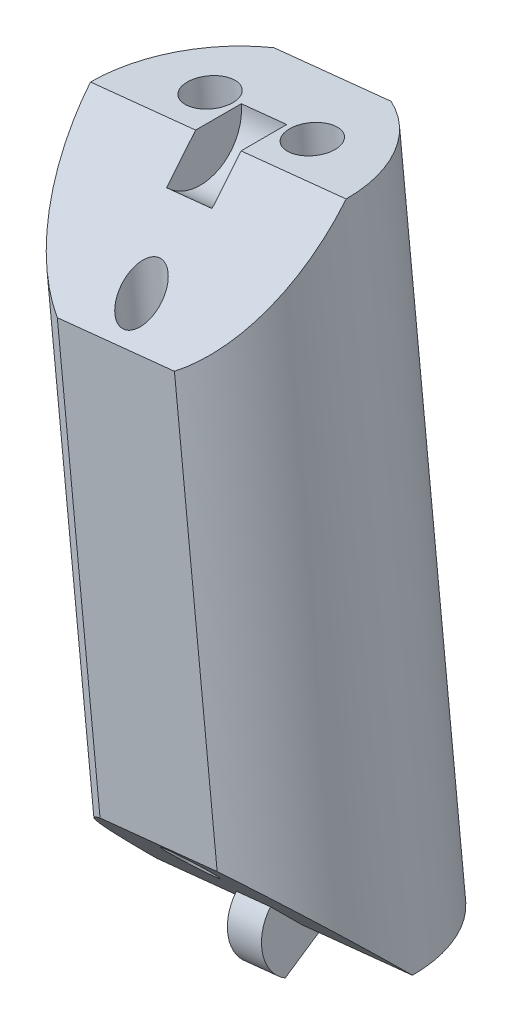
ISO-10303-21;
HEADER;
FILE_DESCRIPTION(('STEP AP214'),'2;1');
FILE_NAME('part.step','',(''),(''),'','','');
FILE_SCHEMA(('AUTOMOTIVE_DESIGN { 1 0 10303 214 1 1 1 1 }'));
ENDSEC;
DATA;
#1=APPLICATION_CONTEXT('core data for automotive mechanical design processes');
#2=APPLICATION_PROTOCOL_DEFINITION('international standard','automotive_design',2000,#1);
#3=PRODUCT_CONTEXT('',#1,'mechanical');
#4=PRODUCT('Part','Part','',(#3));
#5=PRODUCT_RELATED_PRODUCT_CATEGORY('part','',(#4));
#6=PRODUCT_DEFINITION_FORMATION('','',#4);
#7=PRODUCT_DEFINITION_CONTEXT('part definition',#1,'design');
#8=PRODUCT_DEFINITION('design','',#6,#7);
#9=PRODUCT_DEFINITION_SHAPE('','',#8);
#10=(LENGTH_UNIT() NAMED_UNIT(*) SI_UNIT(.MILLI.,.METRE.));
#11=(NAMED_UNIT(*) PLANE_ANGLE_UNIT() SI_UNIT($,.RADIAN.));
#12=(NAMED_UNIT(*) SI_UNIT($,.STERADIAN.) SOLID_ANGLE_UNIT());
#13=UNCERTAINTY_MEASURE_WITH_UNIT(LENGTH_MEASURE(1.E-05),#10,'distance_accuracy_value','');
#14=(GEOMETRIC_REPRESENTATION_CONTEXT(3) GLOBAL_UNCERTAINTY_ASSIGNED_CONTEXT((#13)) GLOBAL_UNIT_ASSIGNED_CONTEXT((#10,
#11,#12)) REPRESENTATION_CONTEXT('',''));
#15=CARTESIAN_POINT('',(0.,0.,0.));
#16=DIRECTION('',(0.,0.,1.));
#17=DIRECTION('',(1.,0.,0.));
#18=AXIS2_PLACEMENT_3D('',#15,#16,#17);
#19=CARTESIAN_POINT('',(-5.32693230149214,152.494838402009,0.));
#20=DIRECTION('',(-0.103150523023817,0.994665757729657,0.));
#21=DIRECTION('',(-0.994665757729657,-0.103150523023817,0.));
#22=AXIS2_PLACEMENT_3D('',#19,#20,#21);
#23=CYLINDRICAL_SURFACE('',#22,9.);
#24=CARTESIAN_POINT('',(-5.32693230149214,152.494838402009,0.));
#25=DIRECTION('',(0.103150523023817,-0.994665757729657,0.));
#26=DIRECTION('',(0.994665757729657,0.103150523023817,0.));
#27=AXIS2_PLACEMENT_3D('',#24,#25,#26);
#28=CIRCLE('',#27,9.);
#29=CARTESIAN_POINT('',(-1.22582032018774,152.920138903774,-8.));
#30=VERTEX_POINT('',#29);
#31=CARTESIAN_POINT('',(3.62505951807477,153.423193109224,0.));
#32=VERTEX_POINT('',#31);
#33=EDGE_CURVE('E143',#30,#32,#28,.T.);
#34=ORIENTED_EDGE('',*,*,#33,.F.);
#35=DIRECTION('',(-0.103150523023817,0.994665757729657,0.));
#36=VECTOR('',#35,1.);
#37=CARTESIAN_POINT('',(-1.22582032018774,152.920138903774,-8.));
#38=LINE('',#37,#36);
#39=CARTESIAN_POINT('',(-5.86759385625949,197.680098001609,-8.));
#40=VERTEX_POINT('',#39);
#41=EDGE_CURVE('E11',#30,#40,#38,.T.);
#42=ORIENTED_EDGE('',*,*,#41,.T.);
#43=CARTESIAN_POINT('',(-9.9687058375639,197.254797499844,0.));
#44=DIRECTION('',(0.103150523023817,-0.994665757729657,0.));
#45=DIRECTION('',(0.994665757729657,0.103150523023817,0.));
#46=AXIS2_PLACEMENT_3D('',#43,#44,#45);
#47=CIRCLE('',#46,9.);
#48=CARTESIAN_POINT('',(-1.01671401799698,198.183152207058,0.));
#49=VERTEX_POINT('',#48);
#50=EDGE_CURVE('E160',#40,#49,#47,.T.);
#51=ORIENTED_EDGE('',*,*,#50,.T.);
#52=CARTESIAN_POINT('',(-9.9687058375639,197.254797499844,0.));
#53=DIRECTION('',(0.0729384343130804,-0.703334902304701,-0.707106781186543));
#54=DIRECTION('',(-0.0729384343130795,0.703334902304692,-0.707106781186552));
#55=AXIS2_PLACEMENT_3D('',#52,#53,#54);
#56=ELLIPSE('',#55,12.7279220613578,9.);
#57=CARTESIAN_POINT('',(-5.04238967206898,189.722771939772,8.));
#58=VERTEX_POINT('',#57);
#59=EDGE_CURVE('E288',#49,#58,#56,.T.);
#60=ORIENTED_EDGE('',*,*,#59,.T.);
#61=DIRECTION('',(-0.103150523023817,0.994665757729657,0.));
#62=VECTOR('',#61,1.);
#63=CARTESIAN_POINT('',(-1.22582032018774,152.920138903774,8.));
#64=LINE('',#63,#62);
#65=CARTESIAN_POINT('',(-2.05102450437827,160.877464965611,8.));
#66=VERTEX_POINT('',#65);
#67=EDGE_CURVE('E175',#58,#66,#64,.F.);
#68=ORIENTED_EDGE('',*,*,#67,.T.);
#69=CARTESIAN_POINT('',(-5.32693230149215,152.494838402009,0.));
#70=DIRECTION('',(-0.0729384343130803,0.7033349023047,-0.707106781186544));
#71=DIRECTION('',(-0.0729384343130796,0.703334902304693,0.707106781186551));
#72=AXIS2_PLACEMENT_3D('',#69,#70,#71);
#73=ELLIPSE('',#72,12.7279220613578,9.);
#74=EDGE_CURVE('E151',#66,#32,#73,.T.);
#75=ORIENTED_EDGE('',*,*,#74,.T.);
#76=EDGE_LOOP('',(#34,#42,#51,#60,#68,#75));
#77=FACE_BOUND('',#76,.T.);
#78=ADVANCED_FACE('F39',(#77),#23,.T.);
#79=CARTESIAN_POINT('',(-9.9687058375639,197.254797499844,0.));
#80=DIRECTION('',(0.103150523023817,-0.994665757729657,0.));
#81=DIRECTION('',(0.994665757729657,0.103150523023817,0.));
#82=AXIS2_PLACEMENT_3D('',#79,#80,#81);
#83=PLANE('',#82);
#84=CARTESIAN_POINT('',(-6.38790910973713,197.62613938273,-3.));
#85=DIRECTION('',(0.103150523023817,-0.994665757729657,0.));
#86=DIRECTION('',(0.994665757729657,0.103150523023817,0.));
#87=AXIS2_PLACEMENT_3D('',#84,#85,#86);
#88=CIRCLE('',#87,1.6);
#89=CARTESIAN_POINT('',(-4.79644389736968,197.791180219568,-3.));
#90=VERTEX_POINT('',#89);
#91=EDGE_CURVE('E190',#90,#90,#88,.T.);
#92=ORIENTED_EDGE('',*,*,#91,.T.);
#93=EDGE_LOOP('',(#92));
#94=FACE_BOUND('',#93,.T.);
#95=CARTESIAN_POINT('',(-13.5495025653907,196.883455616958,-3.));
#96=DIRECTION('',(0.103150523023817,-0.994665757729657,0.));
#97=DIRECTION('',(0.994665757729657,0.103150523023817,0.));
#98=AXIS2_PLACEMENT_3D('',#95,#96,#97);
#99=CIRCLE('',#98,1.6);
#100=CARTESIAN_POINT('',(-11.9580373530232,197.048496453796,-3.));
#101=VERTEX_POINT('',#100);
#102=EDGE_CURVE('E185',#101,#101,#99,.T.);
#103=ORIENTED_EDGE('',*,*,#102,.T.);
#104=EDGE_LOOP('',(#103));
#105=FACE_BOUND('',#104,.T.);
#106=ORIENTED_EDGE('',*,*,#50,.F.);
#107=DIRECTION('',(-0.994665757729657,-0.103150523023817,0.));
#108=VECTOR('',#107,1.);
#109=CARTESIAN_POINT('',(-9.9687058375639,197.254797499844,-8.));
#110=LINE('',#109,#108);
#111=CARTESIAN_POINT('',(-14.0698178188683,196.829496998079,-8.));
#112=VERTEX_POINT('',#111);
#113=EDGE_CURVE('E134',#40,#112,#110,.T.);
#114=ORIENTED_EDGE('',*,*,#113,.T.);
#115=CARTESIAN_POINT('',(-18.9206976571308,196.32644279263,0.));
#116=VERTEX_POINT('',#115);
#117=EDGE_CURVE('E154',#116,#112,#47,.T.);
#118=ORIENTED_EDGE('',*,*,#117,.F.);
#119=DIRECTION('',(0.994665757729657,0.103150523023817,0.));
#120=VECTOR('',#119,1.);
#121=CARTESIAN_POINT('',(-9.9687058375639,197.254797499844,0.));
#122=LINE('',#121,#120);
#123=CARTESIAN_POINT('',(-11.5601710499314,197.089756663006,0.));
#124=VERTEX_POINT('',#123);
#125=EDGE_CURVE('E166',#116,#124,#122,.T.);
#126=ORIENTED_EDGE('',*,*,#125,.T.);
#127=DIRECTION('',(0.,0.,-1.));
#128=VECTOR('',#127,1.);
#129=CARTESIAN_POINT('',(-11.5601710499314,197.089756663006,0.));
#130=LINE('',#129,#128);
#131=CARTESIAN_POINT('',(-11.5601710499314,197.089756663006,-3.2));
#132=VERTEX_POINT('',#131);
#133=EDGE_CURVE('E220',#124,#132,#130,.T.);
#134=ORIENTED_EDGE('',*,*,#133,.T.);
#135=DIRECTION('',(-0.994665757729657,-0.103150523023817,0.));
#136=VECTOR('',#135,1.);
#137=CARTESIAN_POINT('',(-8.37724062519648,197.419838336682,-3.2));
#138=LINE('',#137,#136);
#139=CARTESIAN_POINT('',(-8.37724062519648,197.419838336682,-3.2));
#140=VERTEX_POINT('',#139);
#141=EDGE_CURVE('E233',#140,#132,#138,.T.);
#142=ORIENTED_EDGE('',*,*,#141,.F.);
#143=DIRECTION('',(0.,0.,-1.));
#144=VECTOR('',#143,1.);
#145=CARTESIAN_POINT('',(-8.37724062519648,197.419838336682,0.));
#146=LINE('',#145,#144);
#147=CARTESIAN_POINT('',(-8.37724062519648,197.419838336682,0.));
#148=VERTEX_POINT('',#147);
#149=EDGE_CURVE('E221',#148,#140,#146,.T.);
#150=ORIENTED_EDGE('',*,*,#149,.F.);
#151=EDGE_CURVE('E158',#148,#49,#122,.T.);
#152=ORIENTED_EDGE('',*,*,#151,.T.);
#153=EDGE_LOOP('',(#106,#114,#118,#126,#134,#142,#150,#152));
#154=FACE_BOUND('',#153,.T.);
#155=ADVANCED_FACE('F201',(#94,#105,#154),#83,.F.);
#156=CARTESIAN_POINT('',(3.57567090654064,198.659399532566,0.));
#157=DIRECTION('',(0.0729384343130804,-0.703334902304701,-0.707106781186543));
#158=DIRECTION('',(0.,0.708995228875744,-0.705213276556413));
#159=AXIS2_PLACEMENT_3D('',#156,#157,#158);
#160=PLANE('',#159);
#161=CARTESIAN_POINT('',(-9.34980269942101,191.286802953466,6.));
#162=DIRECTION('',(0.0729384343130804,-0.703334902304701,-0.707106781186543));
#163=DIRECTION('',(-0.0729384343130795,0.703334902304692,-0.707106781186552));
#164=AXIS2_PLACEMENT_3D('',#161,#162,#163);
#165=ELLIPSE('',#164,1.97989898732232,1.4);
#166=CARTESIAN_POINT('',(-9.49421343165435,192.679335014288,4.6));
#167=VERTEX_POINT('',#166);
#168=EDGE_CURVE('E180',#167,#167,#165,.T.);
#169=ORIENTED_EDGE('',*,*,#168,.T.);
#170=EDGE_LOOP('',(#169));
#171=FACE_BOUND('',#170,.T.);
#172=CARTESIAN_POINT('',(-13.2446136346778,188.872170936242,8.));
#173=VERTEX_POINT('',#172);
#174=EDGE_CURVE('E287',#173,#116,#56,.T.);
#175=ORIENTED_EDGE('',*,*,#174,.F.);
#176=DIRECTION('',(0.994665757729657,0.103150523023817,0.));
#177=VECTOR('',#176,1.);
#178=CARTESIAN_POINT('',(4.40087509073116,190.702073470729,8.));
#179=LINE('',#178,#177);
#180=EDGE_CURVE('E204',#173,#58,#179,.T.);
#181=ORIENTED_EDGE('',*,*,#180,.T.);
#182=ORIENTED_EDGE('',*,*,#59,.F.);
#183=ORIENTED_EDGE('',*,*,#151,.F.);
#184=DIRECTION('',(-0.0729384343130808,0.703334902304703,-0.707106781186541));
#185=VECTOR('',#184,1.);
#186=CARTESIAN_POINT('',(-8.14383763539462,195.169166649307,2.26274169979694));
#187=LINE('',#186,#185);
#188=CARTESIAN_POINT('',(-8.14383763539462,195.169166649307,2.26274169979694));
#189=VERTEX_POINT('',#188);
#190=EDGE_CURVE('E230',#189,#148,#187,.T.);
#191=ORIENTED_EDGE('',*,*,#190,.F.);
#192=DIRECTION('',(-0.994665757729657,-0.103150523023817,0.));
#193=VECTOR('',#192,1.);
#194=CARTESIAN_POINT('',(-8.14383763539462,195.169166649307,2.26274169979694));
#195=LINE('',#194,#193);
#196=CARTESIAN_POINT('',(-11.3267680601295,194.839084975631,2.26274169979694));
#197=VERTEX_POINT('',#196);
#198=EDGE_CURVE('E243',#189,#197,#195,.T.);
#199=ORIENTED_EDGE('',*,*,#198,.T.);
#200=DIRECTION('',(-0.0729384343130808,0.703334902304703,-0.707106781186541));
#201=VECTOR('',#200,1.);
#202=CARTESIAN_POINT('',(-11.3267680601295,194.839084975631,2.26274169979694));
#203=LINE('',#202,#201);
#204=EDGE_CURVE('E226',#197,#124,#203,.T.);
#205=ORIENTED_EDGE('',*,*,#204,.T.);
#206=ORIENTED_EDGE('',*,*,#125,.F.);
#207=EDGE_LOOP('',(#175,#181,#182,#183,#191,#199,#205,#206));
#208=FACE_BOUND('',#207,.T.);
#209=ADVANCED_FACE('F297',(#171,#208),#160,.F.);
#210=CARTESIAN_POINT('',(-5.32693230149214,152.494838402009,0.));
#211=DIRECTION('',(0.103150523023817,-0.994665757729657,0.));
#212=DIRECTION('',(0.994665757729657,0.103150523023817,0.));
#213=AXIS2_PLACEMENT_3D('',#210,#211,#212);
#214=PLANE('',#213);
#215=DIRECTION('',(-0.994665757729657,-0.103150523023815,0.));
#216=VECTOR('',#215,1.);
#217=CARTESIAN_POINT('',(-9.42804428279655,152.069537900244,-8.));
#218=LINE('',#217,#216);
#219=CARTESIAN_POINT('',(-9.42804428279655,152.069537900244,-8.));
#220=VERTEX_POINT('',#219);
#221=EDGE_CURVE('E55',#30,#220,#218,.T.);
#222=ORIENTED_EDGE('',*,*,#221,.F.);
#223=ORIENTED_EDGE('',*,*,#33,.T.);
#224=DIRECTION('',(0.994665757729657,0.103150523023817,0.));
#225=VECTOR('',#224,1.);
#226=CARTESIAN_POINT('',(-5.32693230149214,152.494838402009,0.));
#227=LINE('',#226,#225);
#228=CARTESIAN_POINT('',(-4.13333339221657,152.618619029638,0.));
#229=VERTEX_POINT('',#228);
#230=EDGE_CURVE('E170',#229,#32,#227,.T.);
#231=ORIENTED_EDGE('',*,*,#230,.F.);
#232=DIRECTION('',(0.,0.,-1.));
#233=VECTOR('',#232,1.);
#234=CARTESIAN_POINT('',(-4.13333339221657,152.618619029638,0.));
#235=LINE('',#234,#233);
#236=CARTESIAN_POINT('',(-4.13333339221657,152.618619029638,-2.8));
#237=VERTEX_POINT('',#236);
#238=EDGE_CURVE('E247',#229,#237,#235,.T.);
#239=ORIENTED_EDGE('',*,*,#238,.T.);
#240=DIRECTION('',(0.994665757729657,0.103150523023817,0.));
#241=VECTOR('',#240,1.);
#242=CARTESIAN_POINT('',(-6.52053121076775,152.371057774381,-2.8));
#243=LINE('',#242,#241);
#244=CARTESIAN_POINT('',(-6.52053121076775,152.371057774381,-2.8));
#245=VERTEX_POINT('',#244);
#246=EDGE_CURVE('E284',#245,#237,#243,.T.);
#247=ORIENTED_EDGE('',*,*,#246,.F.);
#248=DIRECTION('',(0.,0.,-1.));
#249=VECTOR('',#248,1.);
#250=CARTESIAN_POINT('',(-6.52053121076775,152.371057774381,0.));
#251=LINE('',#250,#249);
#252=CARTESIAN_POINT('',(-6.52053121076775,152.371057774381,0.));
#253=VERTEX_POINT('',#252);
#254=EDGE_CURVE('E250',#253,#245,#251,.T.);
#255=ORIENTED_EDGE('',*,*,#254,.F.);
#256=CARTESIAN_POINT('',(-14.2789241210591,151.566483694795,0.));
#257=VERTEX_POINT('',#256);
#258=EDGE_CURVE('E171',#257,#253,#227,.T.);
#259=ORIENTED_EDGE('',*,*,#258,.F.);
#260=EDGE_CURVE('E147',#257,#220,#28,.T.);
#261=ORIENTED_EDGE('',*,*,#260,.T.);
#262=EDGE_LOOP('',(#222,#223,#231,#239,#247,#255,#259,#261));
#263=FACE_BOUND('',#262,.T.);
#264=CARTESIAN_POINT('',(-1.74613557366538,152.866180284895,-3.));
#265=DIRECTION('',(0.103150523023817,-0.994665757729657,0.));
#266=DIRECTION('',(0.994665757729657,0.103150523023817,0.));
#267=AXIS2_PLACEMENT_3D('',#264,#265,#266);
#268=CIRCLE('',#267,1.6);
#269=CARTESIAN_POINT('',(-0.154670361297925,153.031221121733,-3.));
#270=VERTEX_POINT('',#269);
#271=EDGE_CURVE('E186',#270,#270,#268,.T.);
#272=ORIENTED_EDGE('',*,*,#271,.F.);
#273=EDGE_LOOP('',(#272));
#274=FACE_BOUND('',#273,.T.);
#275=CARTESIAN_POINT('',(-8.90772902931891,152.123496519124,-3.));
#276=DIRECTION('',(0.103150523023817,-0.994665757729657,0.));
#277=DIRECTION('',(0.994665757729657,0.103150523023817,0.));
#278=AXIS2_PLACEMENT_3D('',#275,#276,#277);
#279=CIRCLE('',#278,1.6);
#280=CARTESIAN_POINT('',(-7.31626381695146,152.288537355962,-3.));
#281=VERTEX_POINT('',#280);
#282=EDGE_CURVE('E181',#281,#281,#279,.T.);
#283=ORIENTED_EDGE('',*,*,#282,.F.);
#284=EDGE_LOOP('',(#283));
#285=FACE_BOUND('',#284,.T.);
#286=ADVANCED_FACE('F140',(#263,#274,#285),#214,.T.);
#287=CARTESIAN_POINT('',(8.2174444426124,153.899440434731,0.));
#288=DIRECTION('',(-0.0729384343130803,0.7033349023047,-0.707106781186544));
#289=DIRECTION('',(0.,0.708995228875745,0.705213276556412));
#290=AXIS2_PLACEMENT_3D('',#287,#288,#289);
#291=PLANE('',#290);
#292=CARTESIAN_POINT('',(-5.94583543963504,158.462832948387,6.));
#293=DIRECTION('',(-0.0729384343130803,0.7033349023047,-0.707106781186544));
#294=DIRECTION('',(-0.0729384343130796,0.703334902304693,0.707106781186551));
#295=AXIS2_PLACEMENT_3D('',#292,#293,#294);
#296=ELLIPSE('',#295,1.97989898732232,1.4);
#297=CARTESIAN_POINT('',(-6.09024617186839,159.855365009209,7.4));
#298=VERTEX_POINT('',#297);
#299=EDGE_CURVE('E176',#298,#298,#296,.T.);
#300=ORIENTED_EDGE('',*,*,#299,.T.);
#301=EDGE_LOOP('',(#300));
#302=FACE_BOUND('',#301,.T.);
#303=ORIENTED_EDGE('',*,*,#74,.F.);
#304=DIRECTION('',(-0.994665757729657,-0.103150523023817,0.));
#305=VECTOR('',#304,1.);
#306=CARTESIAN_POINT('',(7.39224025842187,161.856766496569,8.));
#307=LINE('',#306,#305);
#308=CARTESIAN_POINT('',(-10.2532484669871,160.026863962082,8.));
#309=VERTEX_POINT('',#308);
#310=EDGE_CURVE('E63',#66,#309,#307,.T.);
#311=ORIENTED_EDGE('',*,*,#310,.T.);
#312=EDGE_CURVE('E163',#257,#309,#73,.T.);
#313=ORIENTED_EDGE('',*,*,#312,.F.);
#314=ORIENTED_EDGE('',*,*,#258,.T.);
#315=DIRECTION('',(0.0729384343130813,-0.703334902304709,-0.707106781186535));
#316=VECTOR('',#315,1.);
#317=CARTESIAN_POINT('',(-6.52053121076775,152.371057774381,0.));
#318=LINE('',#317,#316);
#319=CARTESIAN_POINT('',(-6.72475882684438,154.340395500834,1.9798989873223));
#320=VERTEX_POINT('',#319);
#321=EDGE_CURVE('E261',#320,#253,#318,.T.);
#322=ORIENTED_EDGE('',*,*,#321,.F.);
#323=DIRECTION('',(0.994665757729657,0.103150523023817,0.));
#324=VECTOR('',#323,1.);
#325=CARTESIAN_POINT('',(-6.72475882684438,154.340395500834,1.9798989873223));
#326=LINE('',#325,#324);
#327=CARTESIAN_POINT('',(-4.3375610082932,154.587956756091,1.9798989873223));
#328=VERTEX_POINT('',#327);
#329=EDGE_CURVE('E264',#320,#328,#326,.T.);
#330=ORIENTED_EDGE('',*,*,#329,.T.);
#331=DIRECTION('',(0.0729384343130813,-0.703334902304709,-0.707106781186535));
#332=VECTOR('',#331,1.);
#333=CARTESIAN_POINT('',(-4.13333339221657,152.618619029638,0.));
#334=LINE('',#333,#332);
#335=EDGE_CURVE('E255',#328,#229,#334,.T.);
#336=ORIENTED_EDGE('',*,*,#335,.T.);
#337=ORIENTED_EDGE('',*,*,#230,.T.);
#338=EDGE_LOOP('',(#303,#311,#313,#314,#322,#330,#336,#337));
#339=FACE_BOUND('',#338,.T.);
#340=ADVANCED_FACE('F313',(#302,#339),#291,.F.);
#341=ORIENTED_EDGE('',*,*,#117,.T.);
#342=DIRECTION('',(-0.103150523023817,0.994665757729657,0.));
#343=VECTOR('',#342,1.);
#344=CARTESIAN_POINT('',(-9.42804428279655,152.069537900244,-8.));
#345=LINE('',#344,#343);
#346=EDGE_CURVE('E48',#112,#220,#345,.F.);
#347=ORIENTED_EDGE('',*,*,#346,.T.);
#348=ORIENTED_EDGE('',*,*,#260,.F.);
#349=ORIENTED_EDGE('',*,*,#312,.T.);
#350=DIRECTION('',(-0.103150523023817,0.994665757729657,0.));
#351=VECTOR('',#350,1.);
#352=CARTESIAN_POINT('',(-9.42804428279655,152.069537900244,8.));
#353=LINE('',#352,#351);
#354=EDGE_CURVE('E193',#309,#173,#353,.T.);
#355=ORIENTED_EDGE('',*,*,#354,.T.);
#356=ORIENTED_EDGE('',*,*,#174,.T.);
#357=EDGE_LOOP('',(#341,#347,#348,#349,#355,#356));
#358=FACE_BOUND('',#357,.T.);
#359=ADVANCED_FACE('F41',(#358),#23,.T.);
#360=CARTESIAN_POINT('',(-6.52053121076775,152.371057774381,-2.8));
#361=DIRECTION('',(-0.0893309733522772,0.861405814468384,0.499999999999995));
#362=DIRECTION('',(0.,-0.502007025803858,0.864863541862856));
#363=AXIS2_PLACEMENT_3D('',#360,#361,#362);
#364=PLANE('',#363);
#365=DIRECTION('',(0.0515752615119079,-0.497332878864823,0.866025403784442));
#366=VECTOR('',#365,1.);
#367=CARTESIAN_POINT('',(-4.13333339221657,152.618619029638,-2.8));
#368=LINE('',#367,#366);
#369=CARTESIAN_POINT('',(-3.8832066668302,150.206682749127,1.40000000000003));
#370=VERTEX_POINT('',#369);
#371=EDGE_CURVE('E268',#237,#370,#368,.T.);
#372=ORIENTED_EDGE('',*,*,#371,.T.);
#373=DIRECTION('',(0.994665757729657,0.103150523023817,0.));
#374=VECTOR('',#373,1.);
#375=CARTESIAN_POINT('',(-6.27040448538137,149.959121493869,1.40000000000003));
#376=LINE('',#375,#374);
#377=CARTESIAN_POINT('',(-6.27040448538137,149.959121493869,1.40000000000003));
#378=VERTEX_POINT('',#377);
#379=EDGE_CURVE('E280',#378,#370,#376,.T.);
#380=ORIENTED_EDGE('',*,*,#379,.F.);
#381=DIRECTION('',(0.0515752615119079,-0.497332878864823,0.866025403784442));
#382=VECTOR('',#381,1.);
#383=CARTESIAN_POINT('',(-6.52053121076775,152.371057774381,-2.8));
#384=LINE('',#383,#382);
#385=EDGE_CURVE('E254',#245,#378,#384,.T.);
#386=ORIENTED_EDGE('',*,*,#385,.F.);
#387=ORIENTED_EDGE('',*,*,#246,.T.);
#388=EDGE_LOOP('',(#372,#380,#386,#387));
#389=FACE_BOUND('',#388,.T.);
#390=ADVANCED_FACE('F322',(#389),#364,.F.);
#391=CARTESIAN_POINT('',(-6.52053121076775,152.371057774381,0.));
#392=DIRECTION('',(0.994665757729657,0.103150523023817,0.));
#393=DIRECTION('',(-0.103150523023817,0.994665757729657,0.));
#394=AXIS2_PLACEMENT_3D('',#391,#392,#393);
#395=CYLINDRICAL_SURFACE('',#394,2.80000000000001);
#396=CARTESIAN_POINT('',(-4.13333339221657,152.618619029638,0.));
#397=DIRECTION('',(-0.994665757729657,-0.103150523023817,0.));
#398=DIRECTION('',(-0.103150523023817,0.994665757729657,0.));
#399=AXIS2_PLACEMENT_3D('',#396,#397,#398);
#400=CIRCLE('',#399,2.80000000000001);
#401=EDGE_CURVE('E271',#370,#328,#400,.T.);
#402=ORIENTED_EDGE('',*,*,#401,.T.);
#403=ORIENTED_EDGE('',*,*,#329,.F.);
#404=CARTESIAN_POINT('',(-6.52053121076775,152.371057774381,0.));
#405=DIRECTION('',(-0.994665757729657,-0.103150523023817,0.));
#406=DIRECTION('',(-0.103150523023817,0.994665757729657,0.));
#407=AXIS2_PLACEMENT_3D('',#404,#405,#406);
#408=CIRCLE('',#407,2.80000000000001);
#409=EDGE_CURVE('E258',#378,#320,#408,.T.);
#410=ORIENTED_EDGE('',*,*,#409,.F.);
#411=ORIENTED_EDGE('',*,*,#379,.T.);
#412=EDGE_LOOP('',(#402,#403,#410,#411));
#413=FACE_BOUND('',#412,.T.);
#414=ADVANCED_FACE('F332',(#413),#395,.T.);
#415=CARTESIAN_POINT('',(-6.52053121076775,152.371057774381,0.));
#416=DIRECTION('',(0.994665757729657,0.103150523023817,0.));
#417=DIRECTION('',(-0.103150523023817,0.994665757729657,0.));
#418=AXIS2_PLACEMENT_3D('',#415,#416,#417);
#419=PLANE('',#418);
#420=ORIENTED_EDGE('',*,*,#254,.T.);
#421=ORIENTED_EDGE('',*,*,#385,.T.);
#422=ORIENTED_EDGE('',*,*,#409,.T.);
#423=ORIENTED_EDGE('',*,*,#321,.T.);
#424=EDGE_LOOP('',(#420,#421,#422,#423));
#425=FACE_BOUND('',#424,.T.);
#426=ADVANCED_FACE('F325',(#425),#419,.F.);
#427=CARTESIAN_POINT('',(-4.13333339221657,152.618619029638,0.));
#428=DIRECTION('',(0.994665757729657,0.103150523023817,0.));
#429=DIRECTION('',(-0.103150523023817,0.994665757729657,0.));
#430=AXIS2_PLACEMENT_3D('',#427,#428,#429);
#431=PLANE('',#430);
#432=ORIENTED_EDGE('',*,*,#238,.F.);
#433=ORIENTED_EDGE('',*,*,#335,.F.);
#434=ORIENTED_EDGE('',*,*,#401,.F.);
#435=ORIENTED_EDGE('',*,*,#371,.F.);
#436=EDGE_LOOP('',(#432,#433,#434,#435));
#437=FACE_BOUND('',#436,.T.);
#438=ADVANCED_FACE('F318',(#437),#431,.T.);
#439=CARTESIAN_POINT('',(-8.37724062519648,197.419838336682,0.));
#440=DIRECTION('',(-0.994665757729657,-0.103150523023817,0.));
#441=DIRECTION('',(0.103150523023817,-0.994665757729657,0.));
#442=AXIS2_PLACEMENT_3D('',#439,#440,#441);
#443=CYLINDRICAL_SURFACE('',#442,3.2);
#444=CARTESIAN_POINT('',(-11.5601710499314,197.089756663006,0.));
#445=DIRECTION('',(-0.994665757729657,-0.103150523023817,0.));
#446=DIRECTION('',(0.103150523023817,-0.994665757729657,0.));
#447=AXIS2_PLACEMENT_3D('',#444,#445,#446);
#448=CIRCLE('',#447,3.2);
#449=EDGE_CURVE('E237',#132,#197,#448,.T.);
#450=ORIENTED_EDGE('',*,*,#449,.T.);
#451=ORIENTED_EDGE('',*,*,#198,.F.);
#452=CARTESIAN_POINT('',(-8.37724062519648,197.419838336682,0.));
#453=DIRECTION('',(-0.994665757729657,-0.103150523023817,0.));
#454=DIRECTION('',(0.103150523023817,-0.994665757729657,0.));
#455=AXIS2_PLACEMENT_3D('',#452,#453,#454);
#456=CIRCLE('',#455,3.2);
#457=EDGE_CURVE('E225',#140,#189,#456,.T.);
#458=ORIENTED_EDGE('',*,*,#457,.F.);
#459=ORIENTED_EDGE('',*,*,#141,.T.);
#460=EDGE_LOOP('',(#450,#451,#458,#459));
#461=FACE_BOUND('',#460,.T.);
#462=ADVANCED_FACE('F305',(#461),#443,.F.);
#463=CARTESIAN_POINT('',(-8.37724062519648,197.419838336682,0.));
#464=DIRECTION('',(-0.994665757729657,-0.103150523023817,0.));
#465=DIRECTION('',(0.103150523023817,-0.994665757729657,0.));
#466=AXIS2_PLACEMENT_3D('',#463,#464,#465);
#467=PLANE('',#466);
#468=ORIENTED_EDGE('',*,*,#149,.T.);
#469=ORIENTED_EDGE('',*,*,#457,.T.);
#470=ORIENTED_EDGE('',*,*,#190,.T.);
#471=EDGE_LOOP('',(#468,#469,#470));
#472=FACE_BOUND('',#471,.T.);
#473=ADVANCED_FACE('F308',(#472),#467,.T.);
#474=CARTESIAN_POINT('',(-11.5601710499314,197.089756663006,0.));
#475=DIRECTION('',(-0.994665757729657,-0.103150523023817,0.));
#476=DIRECTION('',(0.103150523023817,-0.994665757729657,0.));
#477=AXIS2_PLACEMENT_3D('',#474,#475,#476);
#478=PLANE('',#477);
#479=ORIENTED_EDGE('',*,*,#133,.F.);
#480=ORIENTED_EDGE('',*,*,#204,.F.);
#481=ORIENTED_EDGE('',*,*,#449,.F.);
#482=EDGE_LOOP('',(#479,#480,#481));
#483=FACE_BOUND('',#482,.T.);
#484=ADVANCED_FACE('F303',(#483),#478,.F.);
#485=CARTESIAN_POINT('',(-4.97151753828603,149.06762461395,6.));
#486=DIRECTION('',(-0.103150523023817,0.994665757729657,0.));
#487=DIRECTION('',(-0.994665757729657,-0.103150523023817,0.));
#488=AXIS2_PLACEMENT_3D('',#485,#486,#487);
#489=CYLINDRICAL_SURFACE('',#488,1.4);
#490=ORIENTED_EDGE('',*,*,#299,.F.);
#491=EDGE_LOOP('',(#490));
#492=FACE_BOUND('',#491,.T.);
#493=ORIENTED_EDGE('',*,*,#168,.F.);
#494=EDGE_LOOP('',(#493));
#495=FACE_BOUND('',#494,.T.);
#496=ADVANCED_FACE('F364',(#492,#495),#489,.F.);
#497=CARTESIAN_POINT('',(-8.5523142661128,148.696282731065,-3.));
#498=DIRECTION('',(-0.103150523023817,0.994665757729657,0.));
#499=DIRECTION('',(-0.994665757729657,-0.103150523023817,0.));
#500=AXIS2_PLACEMENT_3D('',#497,#498,#499);
#501=CYLINDRICAL_SURFACE('',#500,1.6);
#502=ORIENTED_EDGE('',*,*,#282,.T.);
#503=EDGE_LOOP('',(#502));
#504=FACE_BOUND('',#503,.T.);
#505=ORIENTED_EDGE('',*,*,#102,.F.);
#506=EDGE_LOOP('',(#505));
#507=FACE_BOUND('',#506,.T.);
#508=ADVANCED_FACE('F366',(#504,#507),#501,.F.);
#509=CARTESIAN_POINT('',(-1.39072081045927,149.438966496836,-3.));
#510=DIRECTION('',(-0.103150523023817,0.994665757729657,0.));
#511=DIRECTION('',(-0.994665757729657,-0.103150523023817,0.));
#512=AXIS2_PLACEMENT_3D('',#509,#510,#511);
#513=CYLINDRICAL_SURFACE('',#512,1.6);
#514=ORIENTED_EDGE('',*,*,#271,.T.);
#515=EDGE_LOOP('',(#514));
#516=FACE_BOUND('',#515,.T.);
#517=ORIENTED_EDGE('',*,*,#91,.F.);
#518=EDGE_LOOP('',(#517));
#519=FACE_BOUND('',#518,.T.);
#520=ADVANCED_FACE('F373',(#516,#519),#513,.F.);
#521=CARTESIAN_POINT('',(-6.05809278646254,199.517051971424,8.));
#522=DIRECTION('',(0.,0.,-1.));
#523=DIRECTION('',(-1.,0.,0.));
#524=AXIS2_PLACEMENT_3D('',#521,#522,#523);
#525=PLANE('',#524);
#526=ORIENTED_EDGE('',*,*,#354,.F.);
#527=ORIENTED_EDGE('',*,*,#310,.F.);
#528=ORIENTED_EDGE('',*,*,#67,.F.);
#529=ORIENTED_EDGE('',*,*,#180,.F.);
#530=EDGE_LOOP('',(#526,#527,#528,#529));
#531=FACE_BOUND('',#530,.T.);
#532=ADVANCED_FACE('F419',(#531),#525,.F.);
#533=CARTESIAN_POINT('',(-14.2603167490713,198.666450967894,-8.));
#534=DIRECTION('',(0.,0.,1.));
#535=DIRECTION('',(1.,0.,0.));
#536=AXIS2_PLACEMENT_3D('',#533,#534,#535);
#537=PLANE('',#536);
#538=ORIENTED_EDGE('',*,*,#41,.F.);
#539=ORIENTED_EDGE('',*,*,#221,.T.);
#540=ORIENTED_EDGE('',*,*,#346,.F.);
#541=ORIENTED_EDGE('',*,*,#113,.F.);
#542=EDGE_LOOP('',(#538,#539,#540,#541));
#543=FACE_BOUND('',#542,.T.);
#544=ADVANCED_FACE('F132',(#543),#537,.F.);
#545=CLOSED_SHELL('',(#78,#155,#209,#286,#340,#359,#390,#414,#426,#438,#462,#473,#484,#496,#508,
#520,#532,#544));
#546=MANIFOLD_SOLID_BREP('B2',#545);
#547=ADVANCED_BREP_SHAPE_REPRESENTATION('',(#18,#546),#14);
#548=SHAPE_DEFINITION_REPRESENTATION(#9,#547);
ENDSEC;
END-ISO-10303-21;
